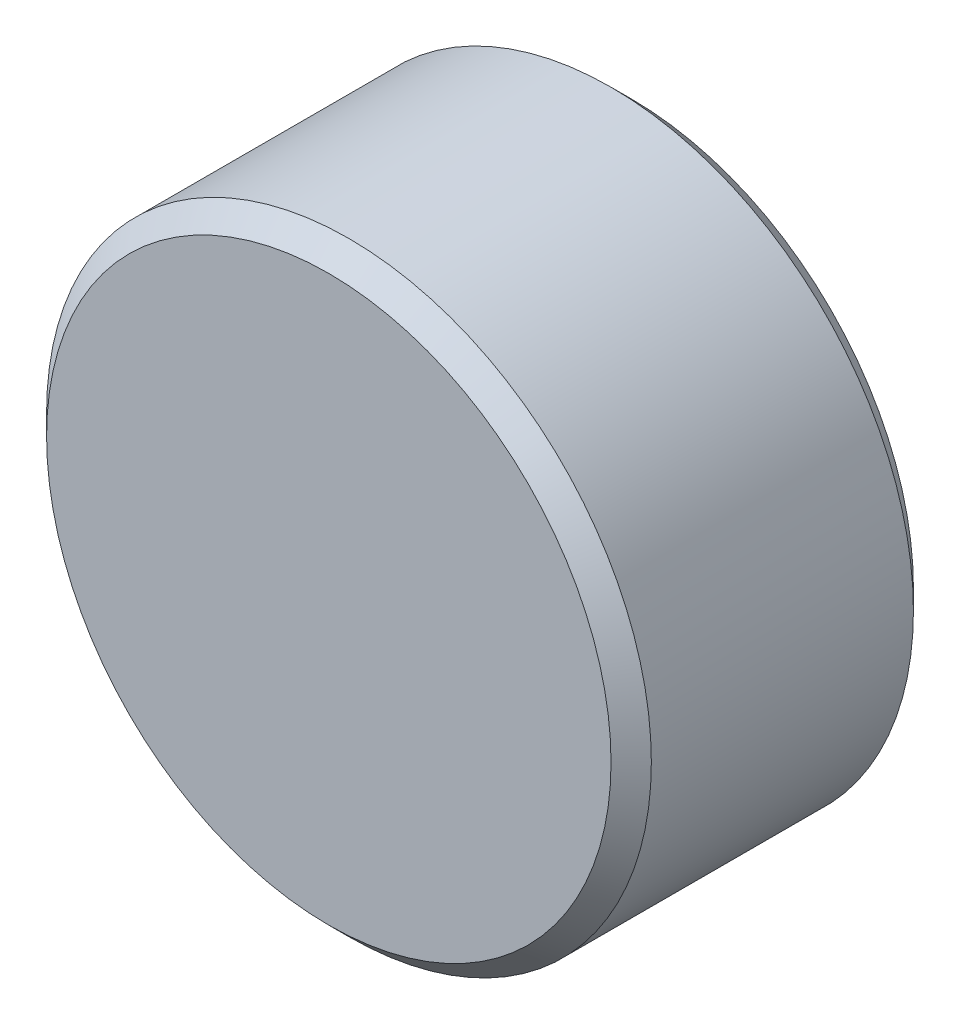
ISO-10303-21;
HEADER;
FILE_DESCRIPTION(('STEP AP214'),'2;1');
FILE_NAME('part.step','',(''),(''),'','','');
FILE_SCHEMA(('AUTOMOTIVE_DESIGN { 1 0 10303 214 1 1 1 1 }'));
ENDSEC;
DATA;
#1=APPLICATION_CONTEXT('core data for automotive mechanical design processes');
#2=APPLICATION_PROTOCOL_DEFINITION('international standard','automotive_design',2000,#1);
#3=PRODUCT_CONTEXT('',#1,'mechanical');
#4=PRODUCT('Part','Part','',(#3));
#5=PRODUCT_RELATED_PRODUCT_CATEGORY('part','',(#4));
#6=PRODUCT_DEFINITION_FORMATION('','',#4);
#7=PRODUCT_DEFINITION_CONTEXT('part definition',#1,'design');
#8=PRODUCT_DEFINITION('design','',#6,#7);
#9=PRODUCT_DEFINITION_SHAPE('','',#8);
#10=(LENGTH_UNIT() NAMED_UNIT(*) SI_UNIT(.MILLI.,.METRE.));
#11=(NAMED_UNIT(*) PLANE_ANGLE_UNIT() SI_UNIT($,.RADIAN.));
#12=(NAMED_UNIT(*) SI_UNIT($,.STERADIAN.) SOLID_ANGLE_UNIT());
#13=UNCERTAINTY_MEASURE_WITH_UNIT(LENGTH_MEASURE(1.E-05),#10,'distance_accuracy_value','');
#14=(GEOMETRIC_REPRESENTATION_CONTEXT(3) GLOBAL_UNCERTAINTY_ASSIGNED_CONTEXT((#13)) GLOBAL_UNIT_ASSIGNED_CONTEXT((#10,
#11,#12)) REPRESENTATION_CONTEXT('',''));
#15=CARTESIAN_POINT('',(0.,0.,0.));
#16=DIRECTION('',(0.,0.,1.));
#17=DIRECTION('',(1.,0.,0.));
#18=AXIS2_PLACEMENT_3D('',#15,#16,#17);
#19=CARTESIAN_POINT('',(0.,0.,-5.));
#20=DIRECTION('',(0.,0.,-1.));
#21=DIRECTION('',(0.,1.,0.));
#22=AXIS2_PLACEMENT_3D('',#19,#20,#21);
#23=PLANE('',#22);
#24=CARTESIAN_POINT('',(0.,0.,-5.0000000000523));
#25=DIRECTION('',(0.,0.,1.));
#26=DIRECTION('',(0.,-1.,0.));
#27=AXIS2_PLACEMENT_3D('',#24,#25,#26);
#28=CIRCLE('',#27,2.79999999997926);
#29=CARTESIAN_POINT('',(0.,-2.79999999997926,-5.0000000000523));
#30=VERTEX_POINT('',#29);
#31=EDGE_CURVE('E17',#30,#30,#28,.T.);
#32=ORIENTED_EDGE('',*,*,#31,.F.);
#33=EDGE_LOOP('',(#32));
#34=FACE_BOUND('',#33,.T.);
#35=ADVANCED_FACE('F14',(#34),#23,.T.);
#36=CARTESIAN_POINT('',(0.,0.,-2.));
#37=DIRECTION('',(0.,0.,-1.));
#38=DIRECTION('',(0.,1.,0.));
#39=AXIS2_PLACEMENT_3D('',#36,#37,#38);
#40=PLANE('',#39);
#41=CARTESIAN_POINT('',(0.,0.,-2.00000000000955));
#42=DIRECTION('',(0.,0.,-1.));
#43=DIRECTION('',(-1.,0.,0.));
#44=AXIS2_PLACEMENT_3D('',#41,#42,#43);
#45=CIRCLE('',#44,2.80000000003611);
#46=CARTESIAN_POINT('',(-2.80000000003611,0.,-2.00000000000955));
#47=VERTEX_POINT('',#46);
#48=EDGE_CURVE('E26',#47,#47,#45,.T.);
#49=ORIENTED_EDGE('',*,*,#48,.F.);
#50=EDGE_LOOP('',(#49));
#51=FACE_BOUND('',#50,.T.);
#52=ADVANCED_FACE('F37',(#51),#40,.F.);
#53=CARTESIAN_POINT('',(0.,0.,-4.80000000015934));
#54=DIRECTION('',(0.,0.,1.));
#55=DIRECTION('',(0.,-1.,0.));
#56=AXIS2_PLACEMENT_3D('',#53,#54,#55);
#57=CONICAL_SURFACE('',#56,2.99999999987222,0.785398163397448);
#58=CARTESIAN_POINT('',(0.,0.,-4.8));
#59=DIRECTION('',(0.,0.,-1.));
#60=DIRECTION('',(0.,1.,0.));
#61=AXIS2_PLACEMENT_3D('',#58,#59,#60);
#62=CIRCLE('',#61,3.);
#63=CARTESIAN_POINT('',(0.,3.,-4.8));
#64=VERTEX_POINT('',#63);
#65=EDGE_CURVE('E21',#64,#64,#62,.F.);
#66=ORIENTED_EDGE('',*,*,#65,.F.);
#67=EDGE_LOOP('',(#66));
#68=FACE_BOUND('',#67,.T.);
#69=ORIENTED_EDGE('',*,*,#31,.T.);
#70=EDGE_LOOP('',(#69));
#71=FACE_BOUND('',#70,.T.);
#72=ADVANCED_FACE('F34',(#68,#71),#57,.T.);
#73=CARTESIAN_POINT('',(0.,0.,-2.20000000001619));
#74=DIRECTION('',(0.,0.,-1.));
#75=DIRECTION('',(-1.,0.,0.));
#76=AXIS2_PLACEMENT_3D('',#73,#74,#75);
#77=CONICAL_SURFACE('',#76,3.00000000004275,0.785398163397448);
#78=ORIENTED_EDGE('',*,*,#48,.T.);
#79=EDGE_LOOP('',(#78));
#80=FACE_BOUND('',#79,.T.);
#81=CARTESIAN_POINT('',(0.,0.,-2.2));
#82=DIRECTION('',(0.,0.,-1.));
#83=DIRECTION('',(0.,1.,0.));
#84=AXIS2_PLACEMENT_3D('',#81,#82,#83);
#85=CIRCLE('',#84,3.);
#86=CARTESIAN_POINT('',(0.,3.,-2.2));
#87=VERTEX_POINT('',#86);
#88=EDGE_CURVE('E10',#87,#87,#85,.T.);
#89=ORIENTED_EDGE('',*,*,#88,.F.);
#90=EDGE_LOOP('',(#89));
#91=FACE_BOUND('',#90,.T.);
#92=ADVANCED_FACE('F45',(#80,#91),#77,.T.);
#93=CARTESIAN_POINT('',(0.,0.,-2.));
#94=DIRECTION('',(0.,0.,-1.));
#95=DIRECTION('',(0.,1.,0.));
#96=AXIS2_PLACEMENT_3D('',#93,#94,#95);
#97=CYLINDRICAL_SURFACE('',#96,3.);
#98=ORIENTED_EDGE('',*,*,#88,.T.);
#99=EDGE_LOOP('',(#98));
#100=FACE_BOUND('',#99,.T.);
#101=ORIENTED_EDGE('',*,*,#65,.T.);
#102=EDGE_LOOP('',(#101));
#103=FACE_BOUND('',#102,.T.);
#104=ADVANCED_FACE('F43',(#100,#103),#97,.T.);
#105=CLOSED_SHELL('',(#35,#52,#72,#92,#104));
#106=MANIFOLD_SOLID_BREP('B1',#105);
#107=ADVANCED_BREP_SHAPE_REPRESENTATION('',(#18,#106),#14);
#108=SHAPE_DEFINITION_REPRESENTATION(#9,#107);
ENDSEC;
END-ISO-10303-21;
